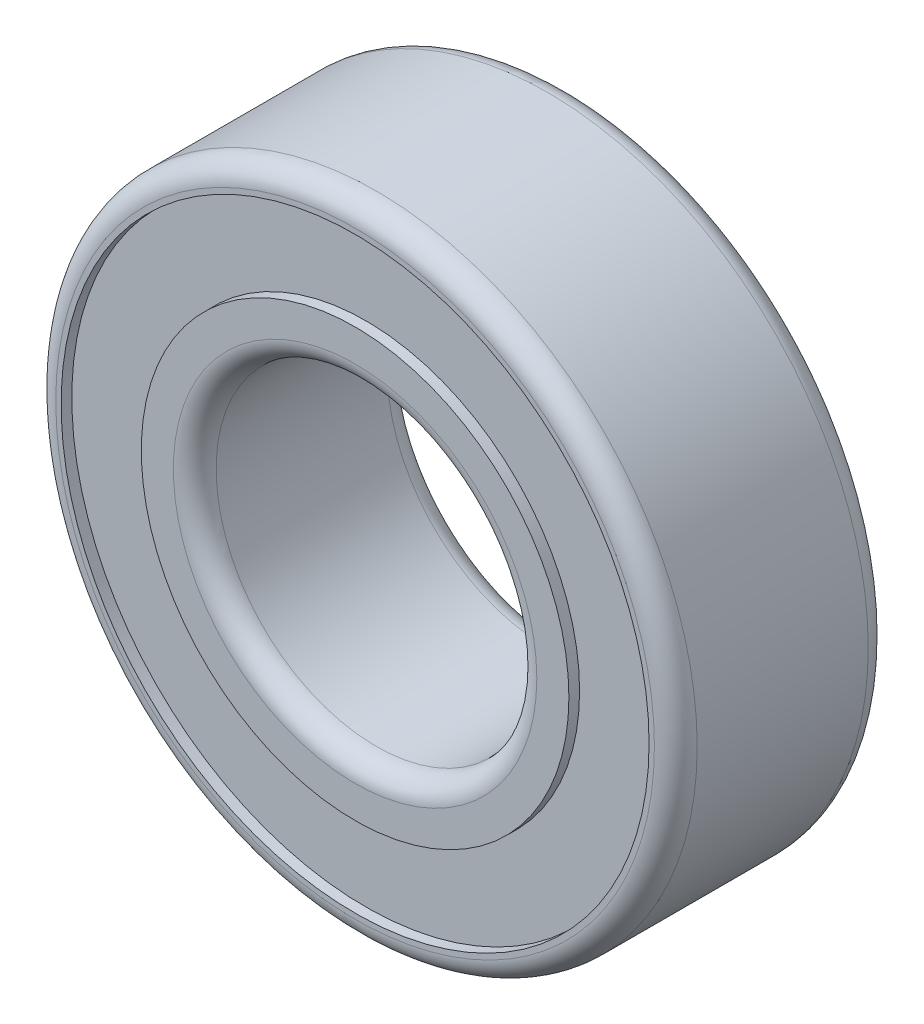
ISO-10303-21;
HEADER;
FILE_DESCRIPTION(('STEP AP214'),'2;1');
FILE_NAME('part.step','',(''),(''),'','','');
FILE_SCHEMA(('AUTOMOTIVE_DESIGN { 1 0 10303 214 1 1 1 1 }'));
ENDSEC;
DATA;
#1=APPLICATION_CONTEXT('core data for automotive mechanical design processes');
#2=APPLICATION_PROTOCOL_DEFINITION('international standard','automotive_design',2000,#1);
#3=PRODUCT_CONTEXT('',#1,'mechanical');
#4=PRODUCT('Part','Part','',(#3));
#5=PRODUCT_RELATED_PRODUCT_CATEGORY('part','',(#4));
#6=PRODUCT_DEFINITION_FORMATION('','',#4);
#7=PRODUCT_DEFINITION_CONTEXT('part definition',#1,'design');
#8=PRODUCT_DEFINITION('design','',#6,#7);
#9=PRODUCT_DEFINITION_SHAPE('','',#8);
#10=(LENGTH_UNIT() NAMED_UNIT(*) SI_UNIT(.MILLI.,.METRE.));
#11=(NAMED_UNIT(*) PLANE_ANGLE_UNIT() SI_UNIT($,.RADIAN.));
#12=(NAMED_UNIT(*) SI_UNIT($,.STERADIAN.) SOLID_ANGLE_UNIT());
#13=UNCERTAINTY_MEASURE_WITH_UNIT(LENGTH_MEASURE(1.E-05),#10,'distance_accuracy_value','');
#14=(GEOMETRIC_REPRESENTATION_CONTEXT(3) GLOBAL_UNCERTAINTY_ASSIGNED_CONTEXT((#13)) GLOBAL_UNIT_ASSIGNED_CONTEXT((#10,
#11,#12)) REPRESENTATION_CONTEXT('',''));
#15=CARTESIAN_POINT('',(0.,0.,0.));
#16=DIRECTION('',(0.,0.,1.));
#17=DIRECTION('',(1.,0.,0.));
#18=AXIS2_PLACEMENT_3D('',#15,#16,#17);
#19=CARTESIAN_POINT('',(0.,0.,-2.));
#20=DIRECTION('',(0.,0.,1.));
#21=DIRECTION('',(1.,0.,0.));
#22=AXIS2_PLACEMENT_3D('',#19,#20,#21);
#23=PLANE('',#22);
#24=CARTESIAN_POINT('',(0.,0.,-2.));
#25=DIRECTION('',(0.,0.,1.));
#26=DIRECTION('',(1.,0.,0.));
#27=AXIS2_PLACEMENT_3D('',#24,#25,#26);
#28=CIRCLE('',#27,3.4);
#29=CARTESIAN_POINT('',(3.4,0.,-2.));
#30=VERTEX_POINT('',#29);
#31=EDGE_CURVE('E59',#30,#30,#28,.T.);
#32=ORIENTED_EDGE('',*,*,#31,.T.);
#33=EDGE_LOOP('',(#32));
#34=FACE_BOUND('',#33,.T.);
#35=CARTESIAN_POINT('',(0.,0.,-2.));
#36=DIRECTION('',(0.,0.,1.));
#37=DIRECTION('',(1.,0.,0.));
#38=AXIS2_PLACEMENT_3D('',#35,#36,#37);
#39=CIRCLE('',#38,4.);
#40=CARTESIAN_POINT('',(4.,0.,-2.));
#41=VERTEX_POINT('',#40);
#42=EDGE_CURVE('E81',#41,#41,#39,.T.);
#43=ORIENTED_EDGE('',*,*,#42,.F.);
#44=EDGE_LOOP('',(#43));
#45=FACE_BOUND('',#44,.T.);
#46=ADVANCED_FACE('F30',(#34,#45),#23,.F.);
#47=CARTESIAN_POINT('',(0.,0.,2.));
#48=DIRECTION('',(0.,0.,1.));
#49=DIRECTION('',(1.,0.,0.));
#50=AXIS2_PLACEMENT_3D('',#47,#48,#49);
#51=PLANE('',#50);
#52=CARTESIAN_POINT('',(0.,0.,2.));
#53=DIRECTION('',(0.,0.,1.));
#54=DIRECTION('',(1.,0.,0.));
#55=AXIS2_PLACEMENT_3D('',#52,#53,#54);
#56=CIRCLE('',#55,3.4);
#57=CARTESIAN_POINT('',(3.4,0.,2.));
#58=VERTEX_POINT('',#57);
#59=EDGE_CURVE('E50',#58,#58,#56,.F.);
#60=ORIENTED_EDGE('',*,*,#59,.T.);
#61=EDGE_LOOP('',(#60));
#62=FACE_BOUND('',#61,.T.);
#63=CARTESIAN_POINT('',(0.,0.,2.));
#64=DIRECTION('',(0.,0.,1.));
#65=DIRECTION('',(1.,0.,0.));
#66=AXIS2_PLACEMENT_3D('',#63,#64,#65);
#67=CIRCLE('',#66,4.);
#68=CARTESIAN_POINT('',(4.,0.,2.));
#69=VERTEX_POINT('',#68);
#70=EDGE_CURVE('E69',#69,#69,#67,.T.);
#71=ORIENTED_EDGE('',*,*,#70,.T.);
#72=EDGE_LOOP('',(#71));
#73=FACE_BOUND('',#72,.T.);
#74=ADVANCED_FACE('F98',(#62,#73),#51,.T.);
#75=CARTESIAN_POINT('',(0.,0.,2.));
#76=DIRECTION('',(0.,0.,1.));
#77=DIRECTION('',(1.,0.,0.));
#78=AXIS2_PLACEMENT_3D('',#75,#76,#77);
#79=CIRCLE('',#78,5.6);
#80=CARTESIAN_POINT('',(5.6,0.,2.));
#81=VERTEX_POINT('',#80);
#82=EDGE_CURVE('E10',#81,#81,#79,.T.);
#83=ORIENTED_EDGE('',*,*,#82,.T.);
#84=EDGE_LOOP('',(#83));
#85=FACE_BOUND('',#84,.T.);
#86=CARTESIAN_POINT('',(0.,0.,2.));
#87=DIRECTION('',(0.,0.,1.));
#88=DIRECTION('',(1.,0.,0.));
#89=AXIS2_PLACEMENT_3D('',#86,#87,#88);
#90=CIRCLE('',#89,5.5);
#91=CARTESIAN_POINT('',(5.5,0.,2.));
#92=VERTEX_POINT('',#91);
#93=EDGE_CURVE('E63',#92,#92,#90,.T.);
#94=ORIENTED_EDGE('',*,*,#93,.F.);
#95=EDGE_LOOP('',(#94));
#96=FACE_BOUND('',#95,.T.);
#97=ADVANCED_FACE('F105',(#85,#96),#51,.T.);
#98=CARTESIAN_POINT('',(0.,0.,-2.));
#99=DIRECTION('',(0.,0.,1.));
#100=DIRECTION('',(1.,0.,0.));
#101=AXIS2_PLACEMENT_3D('',#98,#99,#100);
#102=CIRCLE('',#101,5.6);
#103=CARTESIAN_POINT('',(5.6,0.,-2.));
#104=VERTEX_POINT('',#103);
#105=EDGE_CURVE('E37',#104,#104,#102,.F.);
#106=ORIENTED_EDGE('',*,*,#105,.T.);
#107=EDGE_LOOP('',(#106));
#108=FACE_BOUND('',#107,.T.);
#109=CARTESIAN_POINT('',(0.,0.,-2.));
#110=DIRECTION('',(0.,0.,1.));
#111=DIRECTION('',(1.,0.,0.));
#112=AXIS2_PLACEMENT_3D('',#109,#110,#111);
#113=CIRCLE('',#112,5.5);
#114=CARTESIAN_POINT('',(5.5,0.,-2.));
#115=VERTEX_POINT('',#114);
#116=EDGE_CURVE('E75',#115,#115,#113,.T.);
#117=ORIENTED_EDGE('',*,*,#116,.T.);
#118=EDGE_LOOP('',(#117));
#119=FACE_BOUND('',#118,.T.);
#120=ADVANCED_FACE('F101',(#108,#119),#23,.F.);
#121=CARTESIAN_POINT('',(0.,0.,2.));
#122=DIRECTION('',(0.,0.,-1.));
#123=DIRECTION('',(-1.,0.,0.));
#124=AXIS2_PLACEMENT_3D('',#121,#122,#123);
#125=CYLINDRICAL_SURFACE('',#124,6.);
#126=CARTESIAN_POINT('',(0.,0.,-1.6));
#127=DIRECTION('',(0.,0.,1.));
#128=DIRECTION('',(1.,0.,0.));
#129=AXIS2_PLACEMENT_3D('',#126,#127,#128);
#130=CIRCLE('',#129,6.);
#131=CARTESIAN_POINT('',(6.,0.,-1.6));
#132=VERTEX_POINT('',#131);
#133=EDGE_CURVE('E41',#132,#132,#130,.T.);
#134=ORIENTED_EDGE('',*,*,#133,.T.);
#135=EDGE_LOOP('',(#134));
#136=FACE_BOUND('',#135,.T.);
#137=CARTESIAN_POINT('',(0.,0.,1.6));
#138=DIRECTION('',(0.,0.,1.));
#139=DIRECTION('',(1.,0.,0.));
#140=AXIS2_PLACEMENT_3D('',#137,#138,#139);
#141=CIRCLE('',#140,6.);
#142=CARTESIAN_POINT('',(6.,0.,1.6));
#143=VERTEX_POINT('',#142);
#144=EDGE_CURVE('E45',#143,#143,#141,.F.);
#145=ORIENTED_EDGE('',*,*,#144,.T.);
#146=EDGE_LOOP('',(#145));
#147=FACE_BOUND('',#146,.T.);
#148=ADVANCED_FACE('F110',(#136,#147),#125,.T.);
#149=CARTESIAN_POINT('',(0.,0.,2.));
#150=DIRECTION('',(0.,0.,-1.));
#151=DIRECTION('',(-1.,0.,0.));
#152=AXIS2_PLACEMENT_3D('',#149,#150,#151);
#153=CYLINDRICAL_SURFACE('',#152,3.);
#154=CARTESIAN_POINT('',(0.,0.,-1.6));
#155=DIRECTION('',(0.,0.,1.));
#156=DIRECTION('',(1.,0.,0.));
#157=AXIS2_PLACEMENT_3D('',#154,#155,#156);
#158=CIRCLE('',#157,3.);
#159=CARTESIAN_POINT('',(3.,0.,-1.6));
#160=VERTEX_POINT('',#159);
#161=EDGE_CURVE('E53',#160,#160,#158,.F.);
#162=ORIENTED_EDGE('',*,*,#161,.T.);
#163=EDGE_LOOP('',(#162));
#164=FACE_BOUND('',#163,.T.);
#165=CARTESIAN_POINT('',(0.,0.,1.6));
#166=DIRECTION('',(0.,0.,1.));
#167=DIRECTION('',(1.,0.,0.));
#168=AXIS2_PLACEMENT_3D('',#165,#166,#167);
#169=CIRCLE('',#168,3.);
#170=CARTESIAN_POINT('',(3.,0.,1.6));
#171=VERTEX_POINT('',#170);
#172=EDGE_CURVE('E56',#171,#171,#169,.T.);
#173=ORIENTED_EDGE('',*,*,#172,.T.);
#174=EDGE_LOOP('',(#173));
#175=FACE_BOUND('',#174,.T.);
#176=ADVANCED_FACE('F115',(#164,#175),#153,.F.);
#177=CARTESIAN_POINT('',(0.,0.,1.8));
#178=DIRECTION('',(0.,0.,1.));
#179=DIRECTION('',(1.,0.,0.));
#180=AXIS2_PLACEMENT_3D('',#177,#178,#179);
#181=CYLINDRICAL_SURFACE('',#180,5.5);
#182=CARTESIAN_POINT('',(0.,0.,1.8));
#183=DIRECTION('',(0.,0.,1.));
#184=DIRECTION('',(1.,0.,0.));
#185=AXIS2_PLACEMENT_3D('',#182,#183,#184);
#186=CIRCLE('',#185,5.5);
#187=CARTESIAN_POINT('',(5.5,0.,1.8));
#188=VERTEX_POINT('',#187);
#189=EDGE_CURVE('E62',#188,#188,#186,.T.);
#190=ORIENTED_EDGE('',*,*,#189,.F.);
#191=EDGE_LOOP('',(#190));
#192=FACE_BOUND('',#191,.T.);
#193=ORIENTED_EDGE('',*,*,#93,.T.);
#194=EDGE_LOOP('',(#193));
#195=FACE_BOUND('',#194,.T.);
#196=ADVANCED_FACE('F136',(#192,#195),#181,.F.);
#197=CARTESIAN_POINT('',(0.,0.,1.8));
#198=DIRECTION('',(0.,0.,1.));
#199=DIRECTION('',(1.,0.,0.));
#200=AXIS2_PLACEMENT_3D('',#197,#198,#199);
#201=PLANE('',#200);
#202=CARTESIAN_POINT('',(0.,0.,1.8));
#203=DIRECTION('',(0.,0.,1.));
#204=DIRECTION('',(1.,0.,0.));
#205=AXIS2_PLACEMENT_3D('',#202,#203,#204);
#206=CIRCLE('',#205,4.);
#207=CARTESIAN_POINT('',(4.,0.,1.8));
#208=VERTEX_POINT('',#207);
#209=EDGE_CURVE('E66',#208,#208,#206,.T.);
#210=ORIENTED_EDGE('',*,*,#209,.F.);
#211=EDGE_LOOP('',(#210));
#212=FACE_BOUND('',#211,.T.);
#213=ORIENTED_EDGE('',*,*,#189,.T.);
#214=EDGE_LOOP('',(#213));
#215=FACE_BOUND('',#214,.T.);
#216=ADVANCED_FACE('F132',(#212,#215),#201,.T.);
#217=CARTESIAN_POINT('',(0.,0.,1.8));
#218=DIRECTION('',(0.,0.,1.));
#219=DIRECTION('',(1.,0.,0.));
#220=AXIS2_PLACEMENT_3D('',#217,#218,#219);
#221=CYLINDRICAL_SURFACE('',#220,4.);
#222=ORIENTED_EDGE('',*,*,#209,.T.);
#223=EDGE_LOOP('',(#222));
#224=FACE_BOUND('',#223,.T.);
#225=ORIENTED_EDGE('',*,*,#70,.F.);
#226=EDGE_LOOP('',(#225));
#227=FACE_BOUND('',#226,.T.);
#228=ADVANCED_FACE('F126',(#224,#227),#221,.T.);
#229=CARTESIAN_POINT('',(0.,0.,-1.8));
#230=DIRECTION('',(0.,0.,-1.));
#231=DIRECTION('',(1.,0.,0.));
#232=AXIS2_PLACEMENT_3D('',#229,#230,#231);
#233=PLANE('',#232);
#234=CARTESIAN_POINT('',(0.,0.,-1.8));
#235=DIRECTION('',(0.,0.,1.));
#236=DIRECTION('',(1.,0.,0.));
#237=AXIS2_PLACEMENT_3D('',#234,#235,#236);
#238=CIRCLE('',#237,5.5);
#239=CARTESIAN_POINT('',(5.5,0.,-1.8));
#240=VERTEX_POINT('',#239);
#241=EDGE_CURVE('E72',#240,#240,#238,.T.);
#242=ORIENTED_EDGE('',*,*,#241,.F.);
#243=EDGE_LOOP('',(#242));
#244=FACE_BOUND('',#243,.T.);
#245=CARTESIAN_POINT('',(0.,0.,-1.8));
#246=DIRECTION('',(0.,0.,1.));
#247=DIRECTION('',(1.,0.,0.));
#248=AXIS2_PLACEMENT_3D('',#245,#246,#247);
#249=CIRCLE('',#248,4.);
#250=CARTESIAN_POINT('',(4.,0.,-1.8));
#251=VERTEX_POINT('',#250);
#252=EDGE_CURVE('E78',#251,#251,#249,.T.);
#253=ORIENTED_EDGE('',*,*,#252,.T.);
#254=EDGE_LOOP('',(#253));
#255=FACE_BOUND('',#254,.T.);
#256=ADVANCED_FACE('F87',(#244,#255),#233,.T.);
#257=CARTESIAN_POINT('',(0.,0.,-1.8));
#258=DIRECTION('',(0.,0.,-1.));
#259=DIRECTION('',(-1.,0.,0.));
#260=AXIS2_PLACEMENT_3D('',#257,#258,#259);
#261=CYLINDRICAL_SURFACE('',#260,5.5);
#262=ORIENTED_EDGE('',*,*,#241,.T.);
#263=EDGE_LOOP('',(#262));
#264=FACE_BOUND('',#263,.T.);
#265=ORIENTED_EDGE('',*,*,#116,.F.);
#266=EDGE_LOOP('',(#265));
#267=FACE_BOUND('',#266,.T.);
#268=ADVANCED_FACE('F93',(#264,#267),#261,.F.);
#269=CARTESIAN_POINT('',(0.,0.,-1.8));
#270=DIRECTION('',(0.,0.,-1.));
#271=DIRECTION('',(-1.,0.,0.));
#272=AXIS2_PLACEMENT_3D('',#269,#270,#271);
#273=CYLINDRICAL_SURFACE('',#272,4.);
#274=ORIENTED_EDGE('',*,*,#252,.F.);
#275=EDGE_LOOP('',(#274));
#276=FACE_BOUND('',#275,.T.);
#277=ORIENTED_EDGE('',*,*,#42,.T.);
#278=EDGE_LOOP('',(#277));
#279=FACE_BOUND('',#278,.T.);
#280=ADVANCED_FACE('F89',(#276,#279),#273,.T.);
#281=CARTESIAN_POINT('',(0.,0.,-1.6));
#282=DIRECTION('',(0.,0.,1.));
#283=DIRECTION('',(1.,0.,0.));
#284=AXIS2_PLACEMENT_3D('',#281,#282,#283);
#285=TOROIDAL_SURFACE('',#284,3.4,0.4);
#286=ORIENTED_EDGE('',*,*,#161,.F.);
#287=EDGE_LOOP('',(#286));
#288=FACE_BOUND('',#287,.T.);
#289=ORIENTED_EDGE('',*,*,#31,.F.);
#290=EDGE_LOOP('',(#289));
#291=FACE_BOUND('',#290,.T.);
#292=ADVANCED_FACE('F92',(#288,#291),#285,.T.);
#293=CARTESIAN_POINT('',(0.,0.,1.6));
#294=DIRECTION('',(0.,0.,1.));
#295=DIRECTION('',(1.,0.,0.));
#296=AXIS2_PLACEMENT_3D('',#293,#294,#295);
#297=TOROIDAL_SURFACE('',#296,3.4,0.4);
#298=ORIENTED_EDGE('',*,*,#59,.F.);
#299=EDGE_LOOP('',(#298));
#300=FACE_BOUND('',#299,.T.);
#301=ORIENTED_EDGE('',*,*,#172,.F.);
#302=EDGE_LOOP('',(#301));
#303=FACE_BOUND('',#302,.T.);
#304=ADVANCED_FACE('F149',(#300,#303),#297,.T.);
#305=CARTESIAN_POINT('',(0.,0.,-1.6));
#306=DIRECTION('',(0.,0.,1.));
#307=DIRECTION('',(1.,0.,0.));
#308=AXIS2_PLACEMENT_3D('',#305,#306,#307);
#309=TOROIDAL_SURFACE('',#308,5.6,0.4);
#310=ORIENTED_EDGE('',*,*,#105,.F.);
#311=EDGE_LOOP('',(#310));
#312=FACE_BOUND('',#311,.T.);
#313=ORIENTED_EDGE('',*,*,#133,.F.);
#314=EDGE_LOOP('',(#313));
#315=FACE_BOUND('',#314,.T.);
#316=ADVANCED_FACE('F151',(#312,#315),#309,.T.);
#317=CARTESIAN_POINT('',(0.,0.,1.6));
#318=DIRECTION('',(0.,0.,1.));
#319=DIRECTION('',(1.,0.,0.));
#320=AXIS2_PLACEMENT_3D('',#317,#318,#319);
#321=TOROIDAL_SURFACE('',#320,5.6,0.4);
#322=ORIENTED_EDGE('',*,*,#144,.F.);
#323=EDGE_LOOP('',(#322));
#324=FACE_BOUND('',#323,.T.);
#325=ORIENTED_EDGE('',*,*,#82,.F.);
#326=EDGE_LOOP('',(#325));
#327=FACE_BOUND('',#326,.T.);
#328=ADVANCED_FACE('F32',(#324,#327),#321,.T.);
#329=CLOSED_SHELL('',(#46,#74,#97,#120,#148,#176,#196,#216,#228,#256,#268,#280,#292,#304,#316,#328));
#330=MANIFOLD_SOLID_BREP('B2',#329);
#331=ADVANCED_BREP_SHAPE_REPRESENTATION('',(#18,#330),#14);
#332=SHAPE_DEFINITION_REPRESENTATION(#9,#331);
ENDSEC;
END-ISO-10303-21;
